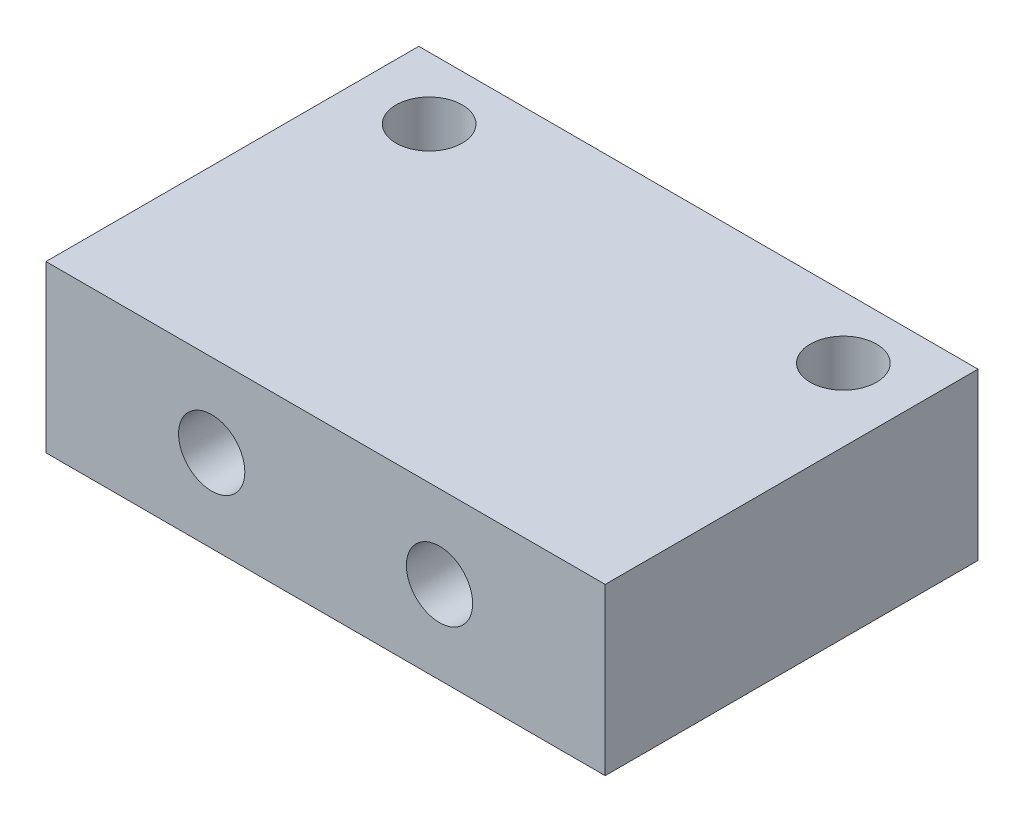
ISO-10303-21;
HEADER;
FILE_DESCRIPTION(('STEP AP214'),'2;1');
FILE_NAME('part.step','',(''),(''),'','','');
FILE_SCHEMA(('AUTOMOTIVE_DESIGN { 1 0 10303 214 1 1 1 1 }'));
ENDSEC;
DATA;
#1=APPLICATION_CONTEXT('core data for automotive mechanical design processes');
#2=APPLICATION_PROTOCOL_DEFINITION('international standard','automotive_design',2000,#1);
#3=PRODUCT_CONTEXT('',#1,'mechanical');
#4=PRODUCT('Part','Part','',(#3));
#5=PRODUCT_RELATED_PRODUCT_CATEGORY('part','',(#4));
#6=PRODUCT_DEFINITION_FORMATION('','',#4);
#7=PRODUCT_DEFINITION_CONTEXT('part definition',#1,'design');
#8=PRODUCT_DEFINITION('design','',#6,#7);
#9=PRODUCT_DEFINITION_SHAPE('','',#8);
#10=(LENGTH_UNIT() NAMED_UNIT(*) SI_UNIT(.MILLI.,.METRE.));
#11=(NAMED_UNIT(*) PLANE_ANGLE_UNIT() SI_UNIT($,.RADIAN.));
#12=(NAMED_UNIT(*) SI_UNIT($,.STERADIAN.) SOLID_ANGLE_UNIT());
#13=UNCERTAINTY_MEASURE_WITH_UNIT(LENGTH_MEASURE(1.E-05),#10,'distance_accuracy_value','');
#14=(GEOMETRIC_REPRESENTATION_CONTEXT(3) GLOBAL_UNCERTAINTY_ASSIGNED_CONTEXT((#13)) GLOBAL_UNIT_ASSIGNED_CONTEXT((#10,
#11,#12)) REPRESENTATION_CONTEXT('',''));
#15=CARTESIAN_POINT('',(0.,0.,0.));
#16=DIRECTION('',(0.,0.,1.));
#17=DIRECTION('',(1.,0.,0.));
#18=AXIS2_PLACEMENT_3D('',#15,#16,#17);
#19=CARTESIAN_POINT('',(0.,8.,0.));
#20=DIRECTION('',(0.,-1.,0.));
#21=DIRECTION('',(0.,0.,-1.));
#22=AXIS2_PLACEMENT_3D('',#19,#20,#21);
#23=PLANE('',#22);
#24=DIRECTION('',(0.,0.,-1.));
#25=VECTOR('',#24,1.);
#26=CARTESIAN_POINT('',(23.5,8.,3.));
#27=LINE('',#26,#25);
#28=CARTESIAN_POINT('',(23.5,8.,15.));
#29=VERTEX_POINT('',#28);
#30=CARTESIAN_POINT('',(23.5,8.,-3.));
#31=VERTEX_POINT('',#30);
#32=EDGE_CURVE('E96',#29,#31,#27,.T.);
#33=ORIENTED_EDGE('',*,*,#32,.T.);
#34=DIRECTION('',(-1.,0.,0.));
#35=VECTOR('',#34,1.);
#36=CARTESIAN_POINT('',(-3.5,8.,-3.));
#37=LINE('',#36,#35);
#38=CARTESIAN_POINT('',(-3.5,8.,-3.));
#39=VERTEX_POINT('',#38);
#40=EDGE_CURVE('E63',#31,#39,#37,.T.);
#41=ORIENTED_EDGE('',*,*,#40,.T.);
#42=DIRECTION('',(0.,0.,1.));
#43=VECTOR('',#42,1.);
#44=CARTESIAN_POINT('',(-3.5,8.,3.));
#45=LINE('',#44,#43);
#46=CARTESIAN_POINT('',(-3.5,8.,15.));
#47=VERTEX_POINT('',#46);
#48=EDGE_CURVE('E78',#39,#47,#45,.T.);
#49=ORIENTED_EDGE('',*,*,#48,.T.);
#50=DIRECTION('',(-1.,0.,0.));
#51=VECTOR('',#50,1.);
#52=CARTESIAN_POINT('',(-3.5,8.,15.));
#53=LINE('',#52,#51);
#54=EDGE_CURVE('E111',#29,#47,#53,.T.);
#55=ORIENTED_EDGE('',*,*,#54,.F.);
#56=EDGE_LOOP('',(#33,#41,#49,#55));
#57=FACE_BOUND('',#56,.T.);
#58=CARTESIAN_POINT('',(0.,8.,0.));
#59=DIRECTION('',(0.,1.,0.));
#60=DIRECTION('',(0.,0.,1.));
#61=AXIS2_PLACEMENT_3D('',#58,#59,#60);
#62=CIRCLE('',#61,1.6);
#63=CARTESIAN_POINT('',(0.,8.,1.6));
#64=VERTEX_POINT('',#63);
#65=EDGE_CURVE('E136',#64,#64,#62,.T.);
#66=ORIENTED_EDGE('',*,*,#65,.F.);
#67=EDGE_LOOP('',(#66));
#68=FACE_BOUND('',#67,.T.);
#69=CARTESIAN_POINT('',(20.,8.,0.));
#70=DIRECTION('',(0.,1.,0.));
#71=DIRECTION('',(0.,0.,1.));
#72=AXIS2_PLACEMENT_3D('',#69,#70,#71);
#73=CIRCLE('',#72,1.6);
#74=CARTESIAN_POINT('',(20.,8.,1.6));
#75=VERTEX_POINT('',#74);
#76=EDGE_CURVE('E128',#75,#75,#73,.T.);
#77=ORIENTED_EDGE('',*,*,#76,.F.);
#78=EDGE_LOOP('',(#77));
#79=FACE_BOUND('',#78,.T.);
#80=ADVANCED_FACE('F45',(#57,#68,#79),#23,.F.);
#81=CARTESIAN_POINT('',(0.,0.,0.));
#82=DIRECTION('',(0.,-1.,0.));
#83=DIRECTION('',(0.,0.,-1.));
#84=AXIS2_PLACEMENT_3D('',#81,#82,#83);
#85=PLANE('',#84);
#86=CARTESIAN_POINT('',(0.,0.,0.));
#87=DIRECTION('',(0.,1.,0.));
#88=DIRECTION('',(0.,0.,1.));
#89=AXIS2_PLACEMENT_3D('',#86,#87,#88);
#90=CIRCLE('',#89,1.6);
#91=CARTESIAN_POINT('',(0.,0.,1.6));
#92=VERTEX_POINT('',#91);
#93=EDGE_CURVE('E132',#92,#92,#90,.T.);
#94=ORIENTED_EDGE('',*,*,#93,.T.);
#95=EDGE_LOOP('',(#94));
#96=FACE_BOUND('',#95,.T.);
#97=DIRECTION('',(0.,0.,-1.));
#98=VECTOR('',#97,1.);
#99=CARTESIAN_POINT('',(23.5,0.,3.));
#100=LINE('',#99,#98);
#101=CARTESIAN_POINT('',(23.5,0.,15.));
#102=VERTEX_POINT('',#101);
#103=CARTESIAN_POINT('',(23.5,0.,-3.));
#104=VERTEX_POINT('',#103);
#105=EDGE_CURVE('E103',#102,#104,#100,.T.);
#106=ORIENTED_EDGE('',*,*,#105,.F.);
#107=DIRECTION('',(1.,0.,0.));
#108=VECTOR('',#107,1.);
#109=CARTESIAN_POINT('',(-3.5,0.,15.));
#110=LINE('',#109,#108);
#111=CARTESIAN_POINT('',(-3.5,0.,15.));
#112=VERTEX_POINT('',#111);
#113=EDGE_CURVE('E99',#112,#102,#110,.T.);
#114=ORIENTED_EDGE('',*,*,#113,.F.);
#115=DIRECTION('',(0.,0.,1.));
#116=VECTOR('',#115,1.);
#117=CARTESIAN_POINT('',(-3.5,0.,3.));
#118=LINE('',#117,#116);
#119=CARTESIAN_POINT('',(-3.5,0.,-3.));
#120=VERTEX_POINT('',#119);
#121=EDGE_CURVE('E90',#120,#112,#118,.T.);
#122=ORIENTED_EDGE('',*,*,#121,.F.);
#123=DIRECTION('',(-1.,0.,0.));
#124=VECTOR('',#123,1.);
#125=CARTESIAN_POINT('',(-3.5,0.,-3.));
#126=LINE('',#125,#124);
#127=EDGE_CURVE('E74',#104,#120,#126,.T.);
#128=ORIENTED_EDGE('',*,*,#127,.F.);
#129=EDGE_LOOP('',(#106,#114,#122,#128));
#130=FACE_BOUND('',#129,.T.);
#131=CARTESIAN_POINT('',(20.,0.,0.));
#132=DIRECTION('',(0.,1.,0.));
#133=DIRECTION('',(0.,0.,1.));
#134=AXIS2_PLACEMENT_3D('',#131,#132,#133);
#135=CIRCLE('',#134,1.6);
#136=CARTESIAN_POINT('',(20.,0.,1.6));
#137=VERTEX_POINT('',#136);
#138=EDGE_CURVE('E127',#137,#137,#135,.T.);
#139=ORIENTED_EDGE('',*,*,#138,.T.);
#140=EDGE_LOOP('',(#139));
#141=FACE_BOUND('',#140,.T.);
#142=ADVANCED_FACE('F100',(#96,#130,#141),#85,.T.);
#143=CARTESIAN_POINT('',(23.5,8.,3.));
#144=DIRECTION('',(-1.,0.,0.));
#145=DIRECTION('',(0.,0.,1.));
#146=AXIS2_PLACEMENT_3D('',#143,#144,#145);
#147=PLANE('',#146);
#148=ORIENTED_EDGE('',*,*,#105,.T.);
#149=DIRECTION('',(0.,-1.,0.));
#150=VECTOR('',#149,1.);
#151=CARTESIAN_POINT('',(23.5,8.,-3.));
#152=LINE('',#151,#150);
#153=EDGE_CURVE('E11',#31,#104,#152,.T.);
#154=ORIENTED_EDGE('',*,*,#153,.F.);
#155=ORIENTED_EDGE('',*,*,#32,.F.);
#156=DIRECTION('',(0.,1.,0.));
#157=VECTOR('',#156,1.);
#158=CARTESIAN_POINT('',(23.5,0.,15.));
#159=LINE('',#158,#157);
#160=EDGE_CURVE('E108',#102,#29,#159,.T.);
#161=ORIENTED_EDGE('',*,*,#160,.F.);
#162=EDGE_LOOP('',(#148,#154,#155,#161));
#163=FACE_BOUND('',#162,.T.);
#164=ADVANCED_FACE('F47',(#163),#147,.F.);
#165=CARTESIAN_POINT('',(-3.5,8.,-3.));
#166=DIRECTION('',(0.,0.,1.));
#167=DIRECTION('',(1.,0.,0.));
#168=AXIS2_PLACEMENT_3D('',#165,#166,#167);
#169=PLANE('',#168);
#170=CARTESIAN_POINT('',(4.5,4.,-3.));
#171=DIRECTION('',(0.,0.,1.));
#172=DIRECTION('',(1.,0.,0.));
#173=AXIS2_PLACEMENT_3D('',#170,#171,#172);
#174=CIRCLE('',#173,1.6);
#175=CARTESIAN_POINT('',(6.1,4.,-3.));
#176=VERTEX_POINT('',#175);
#177=EDGE_CURVE('E113',#176,#176,#174,.T.);
#178=ORIENTED_EDGE('',*,*,#177,.T.);
#179=EDGE_LOOP('',(#178));
#180=FACE_BOUND('',#179,.T.);
#181=CARTESIAN_POINT('',(15.5,4.,-3.));
#182=DIRECTION('',(0.,0.,1.));
#183=DIRECTION('',(1.,0.,0.));
#184=AXIS2_PLACEMENT_3D('',#181,#182,#183);
#185=CIRCLE('',#184,1.6);
#186=CARTESIAN_POINT('',(17.1,4.,-3.));
#187=VERTEX_POINT('',#186);
#188=EDGE_CURVE('E120',#187,#187,#185,.T.);
#189=ORIENTED_EDGE('',*,*,#188,.T.);
#190=EDGE_LOOP('',(#189));
#191=FACE_BOUND('',#190,.T.);
#192=ORIENTED_EDGE('',*,*,#127,.T.);
#193=DIRECTION('',(0.,-1.,0.));
#194=VECTOR('',#193,1.);
#195=CARTESIAN_POINT('',(-3.5,8.,-3.));
#196=LINE('',#195,#194);
#197=EDGE_CURVE('E55',#39,#120,#196,.T.);
#198=ORIENTED_EDGE('',*,*,#197,.F.);
#199=ORIENTED_EDGE('',*,*,#40,.F.);
#200=ORIENTED_EDGE('',*,*,#153,.T.);
#201=EDGE_LOOP('',(#192,#198,#199,#200));
#202=FACE_BOUND('',#201,.T.);
#203=ADVANCED_FACE('F154',(#180,#191,#202),#169,.F.);
#204=CARTESIAN_POINT('',(-3.5,8.,3.));
#205=DIRECTION('',(1.,0.,0.));
#206=DIRECTION('',(0.,0.,-1.));
#207=AXIS2_PLACEMENT_3D('',#204,#205,#206);
#208=PLANE('',#207);
#209=ORIENTED_EDGE('',*,*,#121,.T.);
#210=DIRECTION('',(0.,-1.,0.));
#211=VECTOR('',#210,1.);
#212=CARTESIAN_POINT('',(-3.5,0.,15.));
#213=LINE('',#212,#211);
#214=EDGE_CURVE('E94',#47,#112,#213,.T.);
#215=ORIENTED_EDGE('',*,*,#214,.F.);
#216=ORIENTED_EDGE('',*,*,#48,.F.);
#217=ORIENTED_EDGE('',*,*,#197,.T.);
#218=EDGE_LOOP('',(#209,#215,#216,#217));
#219=FACE_BOUND('',#218,.T.);
#220=ADVANCED_FACE('F92',(#219),#208,.F.);
#221=CARTESIAN_POINT('',(0.,8.,0.));
#222=DIRECTION('',(0.,-1.,0.));
#223=DIRECTION('',(0.,0.,-1.));
#224=AXIS2_PLACEMENT_3D('',#221,#222,#223);
#225=CYLINDRICAL_SURFACE('',#224,1.6);
#226=ORIENTED_EDGE('',*,*,#65,.T.);
#227=EDGE_LOOP('',(#226));
#228=FACE_BOUND('',#227,.T.);
#229=ORIENTED_EDGE('',*,*,#93,.F.);
#230=EDGE_LOOP('',(#229));
#231=FACE_BOUND('',#230,.T.);
#232=ADVANCED_FACE('F167',(#228,#231),#225,.F.);
#233=CARTESIAN_POINT('',(20.,8.,0.));
#234=DIRECTION('',(0.,-1.,0.));
#235=DIRECTION('',(0.,0.,-1.));
#236=AXIS2_PLACEMENT_3D('',#233,#234,#235);
#237=CYLINDRICAL_SURFACE('',#236,1.6);
#238=ORIENTED_EDGE('',*,*,#76,.T.);
#239=EDGE_LOOP('',(#238));
#240=FACE_BOUND('',#239,.T.);
#241=ORIENTED_EDGE('',*,*,#138,.F.);
#242=EDGE_LOOP('',(#241));
#243=FACE_BOUND('',#242,.T.);
#244=ADVANCED_FACE('F164',(#240,#243),#237,.F.);
#245=CARTESIAN_POINT('',(0.,0.,15.));
#246=DIRECTION('',(0.,0.,-1.));
#247=DIRECTION('',(-1.,0.,0.));
#248=AXIS2_PLACEMENT_3D('',#245,#246,#247);
#249=PLANE('',#248);
#250=CARTESIAN_POINT('',(4.5,4.,15.));
#251=DIRECTION('',(0.,0.,1.));
#252=DIRECTION('',(1.,0.,0.));
#253=AXIS2_PLACEMENT_3D('',#250,#251,#252);
#254=CIRCLE('',#253,1.6);
#255=CARTESIAN_POINT('',(6.1,4.,15.));
#256=VERTEX_POINT('',#255);
#257=EDGE_CURVE('E117',#256,#256,#254,.T.);
#258=ORIENTED_EDGE('',*,*,#257,.F.);
#259=EDGE_LOOP('',(#258));
#260=FACE_BOUND('',#259,.T.);
#261=CARTESIAN_POINT('',(15.5,4.,15.));
#262=DIRECTION('',(0.,0.,1.));
#263=DIRECTION('',(1.,0.,0.));
#264=AXIS2_PLACEMENT_3D('',#261,#262,#263);
#265=CIRCLE('',#264,1.6);
#266=CARTESIAN_POINT('',(17.1,4.,15.));
#267=VERTEX_POINT('',#266);
#268=EDGE_CURVE('E190',#267,#267,#265,.T.);
#269=ORIENTED_EDGE('',*,*,#268,.F.);
#270=EDGE_LOOP('',(#269));
#271=FACE_BOUND('',#270,.T.);
#272=ORIENTED_EDGE('',*,*,#214,.T.);
#273=ORIENTED_EDGE('',*,*,#113,.T.);
#274=ORIENTED_EDGE('',*,*,#160,.T.);
#275=ORIENTED_EDGE('',*,*,#54,.T.);
#276=EDGE_LOOP('',(#272,#273,#274,#275));
#277=FACE_BOUND('',#276,.T.);
#278=ADVANCED_FACE('F110',(#260,#271,#277),#249,.F.);
#279=CARTESIAN_POINT('',(15.5,4.,-3.));
#280=DIRECTION('',(0.,0.,1.));
#281=DIRECTION('',(1.,0.,0.));
#282=AXIS2_PLACEMENT_3D('',#279,#280,#281);
#283=CYLINDRICAL_SURFACE('',#282,1.6);
#284=ORIENTED_EDGE('',*,*,#188,.F.);
#285=EDGE_LOOP('',(#284));
#286=FACE_BOUND('',#285,.T.);
#287=ORIENTED_EDGE('',*,*,#268,.T.);
#288=EDGE_LOOP('',(#287));
#289=FACE_BOUND('',#288,.T.);
#290=ADVANCED_FACE('F198',(#286,#289),#283,.F.);
#291=CARTESIAN_POINT('',(4.5,4.,-3.));
#292=DIRECTION('',(0.,0.,1.));
#293=DIRECTION('',(1.,0.,0.));
#294=AXIS2_PLACEMENT_3D('',#291,#292,#293);
#295=CYLINDRICAL_SURFACE('',#294,1.6);
#296=ORIENTED_EDGE('',*,*,#177,.F.);
#297=EDGE_LOOP('',(#296));
#298=FACE_BOUND('',#297,.T.);
#299=ORIENTED_EDGE('',*,*,#257,.T.);
#300=EDGE_LOOP('',(#299));
#301=FACE_BOUND('',#300,.T.);
#302=ADVANCED_FACE('F205',(#298,#301),#295,.F.);
#303=CLOSED_SHELL('',(#80,#142,#164,#203,#220,#232,#244,#278,#290,#302));
#304=MANIFOLD_SOLID_BREP('B2',#303);
#305=ADVANCED_BREP_SHAPE_REPRESENTATION('',(#18,#304),#14);
#306=SHAPE_DEFINITION_REPRESENTATION(#9,#305);
ENDSEC;
END-ISO-10303-21;
